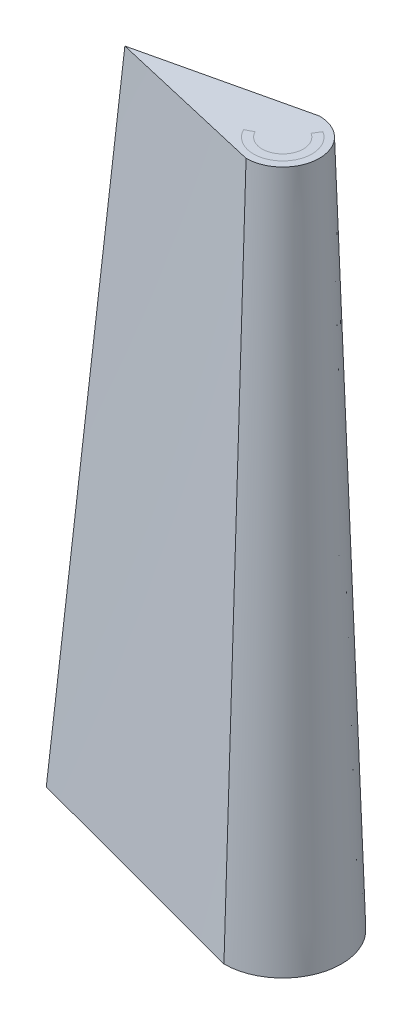
ISO-10303-21;
HEADER;
FILE_DESCRIPTION(('STEP AP214'),'2;1');
FILE_NAME('part.step','',(''),(''),'','','');
FILE_SCHEMA(('AUTOMOTIVE_DESIGN { 1 0 10303 214 1 1 1 1 }'));
ENDSEC;
DATA;
#1=APPLICATION_CONTEXT('core data for automotive mechanical design processes');
#2=APPLICATION_PROTOCOL_DEFINITION('international standard','automotive_design',2000,#1);
#3=PRODUCT_CONTEXT('',#1,'mechanical');
#4=PRODUCT('Part','Part','',(#3));
#5=PRODUCT_RELATED_PRODUCT_CATEGORY('part','',(#4));
#6=PRODUCT_DEFINITION_FORMATION('','',#4);
#7=PRODUCT_DEFINITION_CONTEXT('part definition',#1,'design');
#8=PRODUCT_DEFINITION('design','',#6,#7);
#9=PRODUCT_DEFINITION_SHAPE('','',#8);
#10=(LENGTH_UNIT() NAMED_UNIT(*) SI_UNIT(.MILLI.,.METRE.));
#11=(NAMED_UNIT(*) PLANE_ANGLE_UNIT() SI_UNIT($,.RADIAN.));
#12=(NAMED_UNIT(*) SI_UNIT($,.STERADIAN.) SOLID_ANGLE_UNIT());
#13=UNCERTAINTY_MEASURE_WITH_UNIT(LENGTH_MEASURE(1.E-05),#10,'distance_accuracy_value','');
#14=(GEOMETRIC_REPRESENTATION_CONTEXT(3) GLOBAL_UNCERTAINTY_ASSIGNED_CONTEXT((#13)) GLOBAL_UNIT_ASSIGNED_CONTEXT((#10,
#11,#12)) REPRESENTATION_CONTEXT('',''));
#15=CARTESIAN_POINT('',(0.,0.,0.));
#16=DIRECTION('',(0.,0.,1.));
#17=DIRECTION('',(1.,0.,0.));
#18=AXIS2_PLACEMENT_3D('',#15,#16,#17);
#19=CARTESIAN_POINT('',(0.,2.82502418951988,0.));
#20=DIRECTION('',(0.,1.,0.));
#21=DIRECTION('',(0.,0.,1.));
#22=AXIS2_PLACEMENT_3D('',#19,#20,#21);
#23=PLANE('',#22);
#24=DIRECTION('',(0.974087043427585,0.,0.226173455176565));
#25=VECTOR('',#24,1.);
#26=CARTESIAN_POINT('',(-5.83897076279682,2.82502418951988,0.));
#27=LINE('',#26,#25);
#28=CARTESIAN_POINT('',(-5.83897076279682,2.82502418951988,0.));
#29=VERTEX_POINT('',#28);
#30=CARTESIAN_POINT('',(0.,2.82502418951988,1.35575172774062));
#31=VERTEX_POINT('',#30);
#32=EDGE_CURVE('E129',#29,#31,#27,.T.);
#33=ORIENTED_EDGE('',*,*,#32,.T.);
#34=CARTESIAN_POINT('',(0.,2.82502418951988,0.));
#35=DIRECTION('',(0.,1.,0.));
#36=DIRECTION('',(0.,0.,1.));
#37=AXIS2_PLACEMENT_3D('',#34,#35,#36);
#38=CIRCLE('',#37,1.35575172774062);
#39=CARTESIAN_POINT('',(0.,2.82502418951988,-1.35575172774062));
#40=VERTEX_POINT('',#39);
#41=EDGE_CURVE('E76',#31,#40,#38,.T.);
#42=ORIENTED_EDGE('',*,*,#41,.T.);
#43=DIRECTION('',(-0.974087043427585,0.,0.226173455176565));
#44=VECTOR('',#43,1.);
#45=CARTESIAN_POINT('',(-5.83897076279682,2.82502418951988,0.));
#46=LINE('',#45,#44);
#47=EDGE_CURVE('E15',#40,#29,#46,.T.);
#48=ORIENTED_EDGE('',*,*,#47,.T.);
#49=EDGE_LOOP('',(#33,#42,#48));
#50=FACE_BOUND('',#49,.T.);
#51=ADVANCED_FACE('F66',(#50),#23,.T.);
#52=CARTESIAN_POINT('',(0.,-22.5749758104801,0.));
#53=DIRECTION('',(0.,-1.,0.));
#54=DIRECTION('',(0.,0.,-1.));
#55=AXIS2_PLACEMENT_3D('',#52,#53,#54);
#56=PLANE('',#55);
#57=DIRECTION('',(0.976918229906487,0.,-0.213613604614443));
#58=VECTOR('',#57,1.);
#59=CARTESIAN_POINT('',(-8.96108696617048,-22.5749758104801,-0.215231881348643));
#60=LINE('',#59,#58);
#61=CARTESIAN_POINT('',(-8.96108696617048,-22.5749758104801,-0.215231881348643));
#62=VERTEX_POINT('',#61);
#63=CARTESIAN_POINT('',(0.,-22.5749758104801,-2.17466925236628));
#64=VERTEX_POINT('',#63);
#65=EDGE_CURVE('E109',#62,#64,#60,.T.);
#66=ORIENTED_EDGE('',*,*,#65,.T.);
#67=CARTESIAN_POINT('',(0.,-22.5749758104801,0.));
#68=DIRECTION('',(0.,-1.,0.));
#69=DIRECTION('',(0.,0.,-1.));
#70=AXIS2_PLACEMENT_3D('',#67,#68,#69);
#71=CIRCLE('',#70,2.17466925236629);
#72=CARTESIAN_POINT('',(0.,-22.5749758104801,2.17466925236629));
#73=VERTEX_POINT('',#72);
#74=EDGE_CURVE('E111',#64,#73,#71,.T.);
#75=ORIENTED_EDGE('',*,*,#74,.T.);
#76=DIRECTION('',(-0.966227478003932,0.,-0.257690629923095));
#77=VECTOR('',#76,1.);
#78=CARTESIAN_POINT('',(-8.96108696617048,-22.5749758104801,-0.215231881348643));
#79=LINE('',#78,#77);
#80=EDGE_CURVE('E105',#73,#62,#79,.T.);
#81=ORIENTED_EDGE('',*,*,#80,.T.);
#82=EDGE_LOOP('',(#66,#75,#81));
#83=FACE_BOUND('',#82,.T.);
#84=ADVANCED_FACE('F108',(#83),#56,.T.);
#85=CARTESIAN_POINT('',(0.,-22.5749758104801,-2.17466925236628));
#86=CARTESIAN_POINT('',(0.,2.82502418951988,-1.35575172774062));
#87=CARTESIAN_POINT('',(-1.49351449436175,-22.5749758104801,-1.84809635719668));
#88=CARTESIAN_POINT('',(-0.973161793799471,2.82502418951988,-1.12979310645052));
#89=CARTESIAN_POINT('',(-2.9870289887235,-22.5749758104801,-1.52152346202707));
#90=CARTESIAN_POINT('',(-1.94632358759894,2.82502418951988,-0.903834485160412));
#91=CARTESIAN_POINT('',(-5.97405797744699,-22.5749758104801,-0.868377671687857));
#92=CARTESIAN_POINT('',(-3.89264717519788,2.82502418951988,-0.451917242580206));
#93=CARTESIAN_POINT('',(-7.46757247180874,-22.5749758104801,-0.54180477651825));
#94=CARTESIAN_POINT('',(-4.86580896899735,2.82502418951988,-0.225958621290103));
#95=CARTESIAN_POINT('',(-8.96108696617048,-22.5749758104801,-0.215231881348643));
#96=CARTESIAN_POINT('',(-5.83897076279682,2.82502418951988,0.));
#97=B_SPLINE_SURFACE_WITH_KNOTS('',3,1,((#85,#86),(#87,#88),(#89,#90),(#91,#92),(#93,#94),(#95,
#96)),.UNSPECIFIED.,.F.,.F.,.F.,(4,2,4),(2,2),(0.,0.5,1.),(0.,1.),.UNSPECIFIED.);
#98=DIRECTION('',(0.121995464673084,0.992495026081341,0.00841010124774243));
#99=VECTOR('',#98,1.);
#100=CARTESIAN_POINT('',(-7.40002886448365,-9.87497581048012,-0.107615940674322));
#101=LINE('',#100,#99);
#102=EDGE_CURVE('E124',#62,#29,#101,.T.);
#103=DIRECTION('',(0.,-0.999480668716408,-0.0322241037455294));
#104=VECTOR('',#103,1.);
#105=CARTESIAN_POINT('',(0.,-9.87497581048012,-1.76521049005345));
#106=LINE('',#105,#104);
#107=EDGE_CURVE('E84',#40,#64,#106,.T.);
#108=ORIENTED_EDGE('',*,*,#65,.F.);
#109=ORIENTED_EDGE('',*,*,#102,.T.);
#110=ORIENTED_EDGE('',*,*,#47,.F.);
#111=ORIENTED_EDGE('',*,*,#107,.T.);
#112=EDGE_LOOP('',(#108,#109,#110,#111));
#113=FACE_BOUND('',#112,.T.);
#114=ADVANCED_FACE('F123',(#113),#97,.T.);
#115=CARTESIAN_POINT('',(-8.96108696617048,-22.5749758104801,-0.215231881348643));
#116=CARTESIAN_POINT('',(-5.83897076279682,2.82502418951988,0.));
#117=CARTESIAN_POINT('',(-7.46757247180874,-22.5749758104801,0.183084974270512));
#118=CARTESIAN_POINT('',(-4.86580896899734,2.82502418951988,0.225958621290105));
#119=CARTESIAN_POINT('',(-5.97405797744699,-22.5749758104801,0.581401829889666));
#120=CARTESIAN_POINT('',(-3.89264717519787,2.82502418951988,0.451917242580209));
#121=CARTESIAN_POINT('',(-2.98702898872349,-22.5749758104801,1.37803554112798));
#122=CARTESIAN_POINT('',(-1.94632358759893,2.82502418951988,0.903834485160415));
#123=CARTESIAN_POINT('',(-1.49351449436175,-22.5749758104801,1.77635239674713));
#124=CARTESIAN_POINT('',(-0.973161793799462,2.82502418951988,1.12979310645052));
#125=CARTESIAN_POINT('',(0.,-22.5749758104801,2.17466925236629));
#126=CARTESIAN_POINT('',(0.,2.82502418951988,1.35575172774062));
#127=B_SPLINE_SURFACE_WITH_KNOTS('',3,1,((#115,#116),(#117,#118),(#119,#120),(#121,#122),(#123,
#124),(#125,#126)),.UNSPECIFIED.,.F.,.F.,.F.,(4,2,4),(2,2),(0.,0.5,1.),(0.,1.),.UNSPECIFIED.);
#128=DIRECTION('',(0.,0.999480668716408,-0.0322241037455294));
#129=VECTOR('',#128,1.);
#130=CARTESIAN_POINT('',(0.,-9.87497581048012,1.76521049005345));
#131=LINE('',#130,#129);
#132=EDGE_CURVE('E131',#73,#31,#131,.T.);
#133=ORIENTED_EDGE('',*,*,#80,.F.);
#134=ORIENTED_EDGE('',*,*,#132,.T.);
#135=ORIENTED_EDGE('',*,*,#32,.F.);
#136=ORIENTED_EDGE('',*,*,#102,.F.);
#137=EDGE_LOOP('',(#133,#134,#135,#136));
#138=FACE_BOUND('',#137,.T.);
#139=ADVANCED_FACE('F128',(#138),#127,.T.);
#140=CARTESIAN_POINT('',(0.,-22.5749758104801,0.));
#141=DIRECTION('',(0.,-1.,0.));
#142=DIRECTION('',(0.,0.,-1.));
#143=AXIS2_PLACEMENT_3D('',#140,#141,#142);
#144=CONICAL_SURFACE('',#143,2.17466925236629,0.0322296832329745);
#145=ORIENTED_EDGE('',*,*,#107,.F.);
#146=ORIENTED_EDGE('',*,*,#41,.F.);
#147=ORIENTED_EDGE('',*,*,#132,.F.);
#148=ORIENTED_EDGE('',*,*,#74,.F.);
#149=EDGE_LOOP('',(#145,#146,#147,#148));
#150=FACE_BOUND('',#149,.T.);
#151=ADVANCED_FACE('F147',(#150),#144,.T.);
#152=CLOSED_SHELL('',(#51,#84,#114,#139,#151));
#153=MANIFOLD_SOLID_BREP('B2',#152);
#154=CARTESIAN_POINT('',(-1.07962696498286,2.82502418951988,0.));
#155=DIRECTION('',(0.,1.,0.));
#156=DIRECTION('',(0.,0.,1.));
#157=AXIS2_PLACEMENT_3D('',#154,#155,#156);
#158=PLANE('',#157);
#159=CARTESIAN_POINT('',(0.,2.82502418951988,0.));
#160=DIRECTION('',(0.,1.,0.));
#161=DIRECTION('',(0.,0.,1.));
#162=AXIS2_PLACEMENT_3D('',#159,#160,#161);
#163=CIRCLE('',#162,1.07962696498286);
#164=CARTESIAN_POINT('',(0.,2.82502418951988,1.07962696498286));
#165=VERTEX_POINT('',#164);
#166=EDGE_CURVE('E336',#165,#165,#163,.T.);
#167=ORIENTED_EDGE('',*,*,#166,.T.);
#168=EDGE_LOOP('',(#167));
#169=FACE_BOUND('',#168,.T.);
#170=CARTESIAN_POINT('',(0.,2.82502418951988,0.));
#171=DIRECTION('',(0.,1.,0.));
#172=DIRECTION('',(0.,0.,1.));
#173=AXIS2_PLACEMENT_3D('',#170,#171,#172);
#174=CIRCLE('',#173,0.762);
#175=CARTESIAN_POINT('',(0.,2.82502418951988,0.762));
#176=VERTEX_POINT('',#175);
#177=EDGE_CURVE('E65',#176,#176,#174,.T.);
#178=ORIENTED_EDGE('',*,*,#177,.F.);
#179=EDGE_LOOP('',(#178));
#180=FACE_BOUND('',#179,.T.);
#181=ADVANCED_FACE('F322',(#169,#180),#158,.T.);
#182=CARTESIAN_POINT('',(0.,-22.5749758104801,0.));
#183=DIRECTION('',(0.,-1.,0.));
#184=DIRECTION('',(0.,0.,-1.));
#185=AXIS2_PLACEMENT_3D('',#182,#183,#184);
#186=CONICAL_SURFACE('',#185,1.480393248187,0.0282756607507878);
#187=ORIENTED_EDGE('',*,*,#177,.T.);
#188=EDGE_LOOP('',(#187));
#189=FACE_BOUND('',#188,.T.);
#190=CARTESIAN_POINT('',(0.,-22.5749758104801,0.));
#191=DIRECTION('',(0.,1.,0.));
#192=DIRECTION('',(0.,0.,1.));
#193=AXIS2_PLACEMENT_3D('',#190,#191,#192);
#194=CIRCLE('',#193,1.480393248187);
#195=CARTESIAN_POINT('',(0.,-22.5749758104801,1.480393248187));
#196=VERTEX_POINT('',#195);
#197=EDGE_CURVE('E328',#196,#196,#194,.T.);
#198=ORIENTED_EDGE('',*,*,#197,.F.);
#199=EDGE_LOOP('',(#198));
#200=FACE_BOUND('',#199,.T.);
#201=ADVANCED_FACE('F352',(#189,#200),#186,.F.);
#202=CARTESIAN_POINT('',(-1.480393248187,-22.5749758104801,0.));
#203=DIRECTION('',(0.,-1.,0.));
#204=DIRECTION('',(0.,0.,-1.));
#205=AXIS2_PLACEMENT_3D('',#202,#203,#204);
#206=PLANE('',#205);
#207=ORIENTED_EDGE('',*,*,#197,.T.);
#208=EDGE_LOOP('',(#207));
#209=FACE_BOUND('',#208,.T.);
#210=CARTESIAN_POINT('',(0.,-22.5749758104801,0.));
#211=DIRECTION('',(0.,1.,0.));
#212=DIRECTION('',(0.,0.,1.));
#213=AXIS2_PLACEMENT_3D('',#210,#211,#212);
#214=CIRCLE('',#213,1.79802021316986);
#215=CARTESIAN_POINT('',(0.,-22.5749758104801,1.79802021316986));
#216=VERTEX_POINT('',#215);
#217=EDGE_CURVE('E332',#216,#216,#214,.T.);
#218=ORIENTED_EDGE('',*,*,#217,.F.);
#219=EDGE_LOOP('',(#218));
#220=FACE_BOUND('',#219,.T.);
#221=ADVANCED_FACE('F346',(#209,#220),#206,.T.);
#222=CARTESIAN_POINT('',(0.,2.82502418951988,0.));
#223=DIRECTION('',(0.,-1.,0.));
#224=DIRECTION('',(0.,0.,-1.));
#225=AXIS2_PLACEMENT_3D('',#222,#223,#224);
#226=CONICAL_SURFACE('',#225,1.07962696498286,0.0282756607507878);
#227=ORIENTED_EDGE('',*,*,#217,.T.);
#228=EDGE_LOOP('',(#227));
#229=FACE_BOUND('',#228,.T.);
#230=ORIENTED_EDGE('',*,*,#166,.F.);
#231=EDGE_LOOP('',(#230));
#232=FACE_BOUND('',#231,.T.);
#233=ADVANCED_FACE('F344',(#229,#232),#226,.T.);
#234=CLOSED_SHELL('',(#181,#201,#221,#233));
#235=MANIFOLD_SOLID_BREP('B9',#234);
#236=ADVANCED_BREP_SHAPE_REPRESENTATION('',(#18,#153,#235),#14);
#237=SHAPE_DEFINITION_REPRESENTATION(#9,#236);
ENDSEC;
END-ISO-10303-21;
